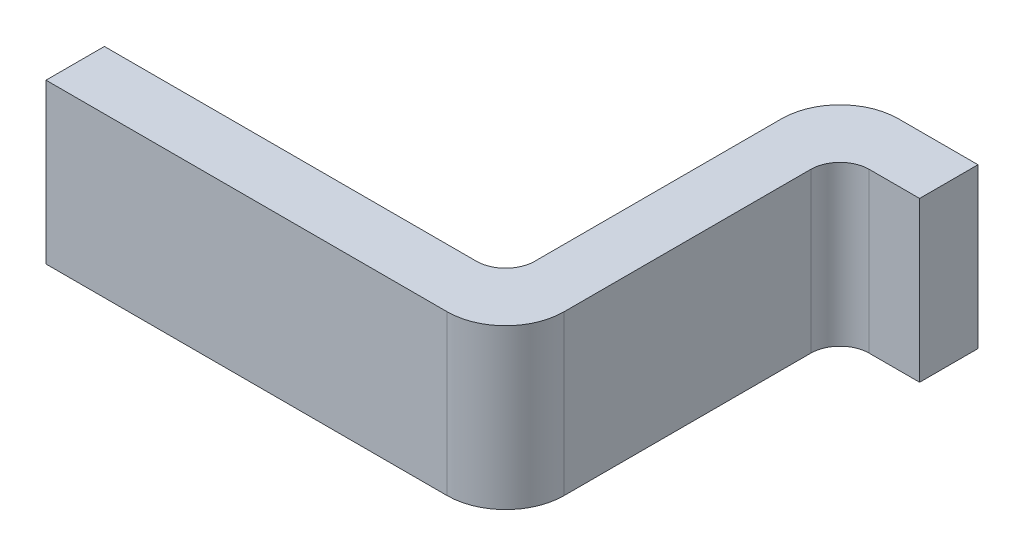
ISO-10303-21;
HEADER;
FILE_DESCRIPTION(('STEP AP214'),'2;1');
FILE_NAME('part.step','',(''),(''),'','','');
FILE_SCHEMA(('AUTOMOTIVE_DESIGN { 1 0 10303 214 1 1 1 1 }'));
ENDSEC;
DATA;
#1=APPLICATION_CONTEXT('core data for automotive mechanical design processes');
#2=APPLICATION_PROTOCOL_DEFINITION('international standard','automotive_design',2000,#1);
#3=PRODUCT_CONTEXT('',#1,'mechanical');
#4=PRODUCT('Part','Part','',(#3));
#5=PRODUCT_RELATED_PRODUCT_CATEGORY('part','',(#4));
#6=PRODUCT_DEFINITION_FORMATION('','',#4);
#7=PRODUCT_DEFINITION_CONTEXT('part definition',#1,'design');
#8=PRODUCT_DEFINITION('design','',#6,#7);
#9=PRODUCT_DEFINITION_SHAPE('','',#8);
#10=(LENGTH_UNIT() NAMED_UNIT(*) SI_UNIT(.MILLI.,.METRE.));
#11=(NAMED_UNIT(*) PLANE_ANGLE_UNIT() SI_UNIT($,.RADIAN.));
#12=(NAMED_UNIT(*) SI_UNIT($,.STERADIAN.) SOLID_ANGLE_UNIT());
#13=UNCERTAINTY_MEASURE_WITH_UNIT(LENGTH_MEASURE(1.E-05),#10,'distance_accuracy_value','');
#14=(GEOMETRIC_REPRESENTATION_CONTEXT(3) GLOBAL_UNCERTAINTY_ASSIGNED_CONTEXT((#13)) GLOBAL_UNIT_ASSIGNED_CONTEXT((#10,
#11,#12)) REPRESENTATION_CONTEXT('',''));
#15=CARTESIAN_POINT('',(0.,0.,0.));
#16=DIRECTION('',(0.,0.,1.));
#17=DIRECTION('',(1.,0.,0.));
#18=AXIS2_PLACEMENT_3D('',#15,#16,#17);
#19=CARTESIAN_POINT('',(1.155,0.,0.165));
#20=DIRECTION('',(0.,-1.,0.));
#21=DIRECTION('',(-0.707106781186548,0.,-0.707106781186547));
#22=AXIS2_PLACEMENT_3D('',#19,#20,#21);
#23=CYLINDRICAL_SURFACE('',#22,0.055);
#24=CARTESIAN_POINT('',(1.155,0.15,0.165));
#25=DIRECTION('',(0.,1.,0.));
#26=DIRECTION('',(0.,0.,-1.));
#27=AXIS2_PLACEMENT_3D('',#24,#25,#26);
#28=CIRCLE('',#27,0.055);
#29=CARTESIAN_POINT('',(1.155,0.15,0.11));
#30=VERTEX_POINT('',#29);
#31=CARTESIAN_POINT('',(1.1,0.15,0.165));
#32=VERTEX_POINT('',#31);
#33=EDGE_CURVE('E11',#30,#32,#28,.T.);
#34=ORIENTED_EDGE('',*,*,#33,.T.);
#35=DIRECTION('',(0.,-1.,0.));
#36=VECTOR('',#35,1.);
#37=CARTESIAN_POINT('',(1.1,0.15,0.165));
#38=LINE('',#37,#36);
#39=CARTESIAN_POINT('',(1.1,-0.15,0.165));
#40=VERTEX_POINT('',#39);
#41=EDGE_CURVE('E24',#32,#40,#38,.T.);
#42=ORIENTED_EDGE('',*,*,#41,.T.);
#43=CARTESIAN_POINT('',(1.155,-0.15,0.165));
#44=DIRECTION('',(0.,-1.,0.));
#45=DIRECTION('',(-1.,0.,0.));
#46=AXIS2_PLACEMENT_3D('',#43,#44,#45);
#47=CIRCLE('',#46,0.055);
#48=CARTESIAN_POINT('',(1.155,-0.15,0.11));
#49=VERTEX_POINT('',#48);
#50=EDGE_CURVE('E193',#40,#49,#47,.T.);
#51=ORIENTED_EDGE('',*,*,#50,.T.);
#52=DIRECTION('',(0.,1.,0.));
#53=VECTOR('',#52,1.);
#54=CARTESIAN_POINT('',(1.155,-0.15,0.11));
#55=LINE('',#54,#53);
#56=EDGE_CURVE('E186',#49,#30,#55,.T.);
#57=ORIENTED_EDGE('',*,*,#56,.T.);
#58=EDGE_LOOP('',(#34,#42,#51,#57));
#59=FACE_BOUND('',#58,.T.);
#60=ADVANCED_FACE('F17',(#59),#23,.F.);
#61=CARTESIAN_POINT('',(1.1,0.,0.739926666323614));
#62=DIRECTION('',(1.,0.,0.));
#63=DIRECTION('',(0.,0.,-1.));
#64=AXIS2_PLACEMENT_3D('',#61,#62,#63);
#65=PLANE('',#64);
#66=ORIENTED_EDGE('',*,*,#41,.F.);
#67=DIRECTION('',(0.,0.,-1.));
#68=VECTOR('',#67,1.);
#69=CARTESIAN_POINT('',(1.1,0.15,0.629926666323614));
#70=LINE('',#69,#68);
#71=CARTESIAN_POINT('',(1.1,0.15,0.629926666323614));
#72=VERTEX_POINT('',#71);
#73=EDGE_CURVE('E195',#72,#32,#70,.T.);
#74=ORIENTED_EDGE('',*,*,#73,.F.);
#75=DIRECTION('',(0.,1.,0.));
#76=VECTOR('',#75,1.);
#77=CARTESIAN_POINT('',(1.1,-0.15,0.629926666323614));
#78=LINE('',#77,#76);
#79=CARTESIAN_POINT('',(1.1,-0.15,0.629926666323614));
#80=VERTEX_POINT('',#79);
#81=EDGE_CURVE('E188',#80,#72,#78,.T.);
#82=ORIENTED_EDGE('',*,*,#81,.F.);
#83=DIRECTION('',(0.,0.,1.));
#84=VECTOR('',#83,1.);
#85=CARTESIAN_POINT('',(1.1,-0.15,0.165));
#86=LINE('',#85,#84);
#87=EDGE_CURVE('E176',#40,#80,#86,.T.);
#88=ORIENTED_EDGE('',*,*,#87,.F.);
#89=EDGE_LOOP('',(#66,#74,#82,#88));
#90=FACE_BOUND('',#89,.T.);
#91=ADVANCED_FACE('F228',(#90),#65,.T.);
#92=CARTESIAN_POINT('',(0.935,0.,0.574926666323615));
#93=DIRECTION('',(0.,1.,0.));
#94=DIRECTION('',(0.707106781186548,0.,0.707106781186547));
#95=AXIS2_PLACEMENT_3D('',#92,#93,#94);
#96=CYLINDRICAL_SURFACE('',#95,0.055);
#97=CARTESIAN_POINT('',(0.935,-0.15,0.574926666323615));
#98=DIRECTION('',(0.,-1.,0.));
#99=DIRECTION('',(1.,0.,0.));
#100=AXIS2_PLACEMENT_3D('',#97,#98,#99);
#101=CIRCLE('',#100,0.055);
#102=CARTESIAN_POINT('',(0.99,-0.15,0.574926666323615));
#103=VERTEX_POINT('',#102);
#104=CARTESIAN_POINT('',(0.935,-0.15,0.629926666323614));
#105=VERTEX_POINT('',#104);
#106=EDGE_CURVE('E197',#103,#105,#101,.T.);
#107=ORIENTED_EDGE('',*,*,#106,.T.);
#108=DIRECTION('',(0.,1.,0.));
#109=VECTOR('',#108,1.);
#110=CARTESIAN_POINT('',(0.935,-0.15,0.629926666323614));
#111=LINE('',#110,#109);
#112=CARTESIAN_POINT('',(0.935,0.15,0.629926666323614));
#113=VERTEX_POINT('',#112);
#114=EDGE_CURVE('E191',#105,#113,#111,.T.);
#115=ORIENTED_EDGE('',*,*,#114,.T.);
#116=CARTESIAN_POINT('',(0.935,0.15,0.574926666323615));
#117=DIRECTION('',(0.,1.,0.));
#118=DIRECTION('',(0.,0.,1.));
#119=AXIS2_PLACEMENT_3D('',#116,#117,#118);
#120=CIRCLE('',#119,0.055);
#121=CARTESIAN_POINT('',(0.99,0.15,0.574926666323615));
#122=VERTEX_POINT('',#121);
#123=EDGE_CURVE('E179',#113,#122,#120,.T.);
#124=ORIENTED_EDGE('',*,*,#123,.T.);
#125=DIRECTION('',(0.,-1.,0.));
#126=VECTOR('',#125,1.);
#127=CARTESIAN_POINT('',(0.99,0.15,0.574926666323615));
#128=LINE('',#127,#126);
#129=EDGE_CURVE('E174',#122,#103,#128,.T.);
#130=ORIENTED_EDGE('',*,*,#129,.T.);
#131=EDGE_LOOP('',(#107,#115,#124,#130));
#132=FACE_BOUND('',#131,.T.);
#133=ADVANCED_FACE('F201',(#132),#96,.F.);
#134=CARTESIAN_POINT('',(1.1,0.,0.629926666323614));
#135=DIRECTION('',(0.,0.,-1.));
#136=DIRECTION('',(-1.,0.,0.));
#137=AXIS2_PLACEMENT_3D('',#134,#135,#136);
#138=PLANE('',#137);
#139=ORIENTED_EDGE('',*,*,#114,.F.);
#140=DIRECTION('',(1.,0.,0.));
#141=VECTOR('',#140,1.);
#142=CARTESIAN_POINT('',(0.234180772746138,-0.15,0.629926666323614));
#143=LINE('',#142,#141);
#144=CARTESIAN_POINT('',(0.234180772746138,-0.15,0.629926666323615));
#145=VERTEX_POINT('',#144);
#146=EDGE_CURVE('E181',#145,#105,#143,.T.);
#147=ORIENTED_EDGE('',*,*,#146,.F.);
#148=DIRECTION('',(0.,1.,0.));
#149=VECTOR('',#148,1.);
#150=CARTESIAN_POINT('',(0.234180772746138,-0.15,0.629926666323615));
#151=LINE('',#150,#149);
#152=CARTESIAN_POINT('',(0.234180772746138,0.15,0.629926666323615));
#153=VERTEX_POINT('',#152);
#154=EDGE_CURVE('E170',#145,#153,#151,.T.);
#155=ORIENTED_EDGE('',*,*,#154,.T.);
#156=DIRECTION('',(-1.,0.,0.));
#157=VECTOR('',#156,1.);
#158=CARTESIAN_POINT('',(0.935,0.15,0.629926666323614));
#159=LINE('',#158,#157);
#160=EDGE_CURVE('E162',#113,#153,#159,.T.);
#161=ORIENTED_EDGE('',*,*,#160,.F.);
#162=EDGE_LOOP('',(#139,#147,#155,#161));
#163=FACE_BOUND('',#162,.T.);
#164=ADVANCED_FACE('F207',(#163),#138,.T.);
#165=CARTESIAN_POINT('',(1.1,0.,0.11));
#166=DIRECTION('',(0.,1.,0.));
#167=DIRECTION('',(-0.707106781186548,0.,-0.707106781186547));
#168=AXIS2_PLACEMENT_3D('',#165,#166,#167);
#169=CYLINDRICAL_SURFACE('',#168,0.11);
#170=CARTESIAN_POINT('',(1.1,0.15,0.11));
#171=DIRECTION('',(0.,-1.,0.));
#172=DIRECTION('',(-1.,0.,0.));
#173=AXIS2_PLACEMENT_3D('',#170,#171,#172);
#174=CIRCLE('',#173,0.11);
#175=CARTESIAN_POINT('',(0.99,0.15,0.11));
#176=VERTEX_POINT('',#175);
#177=CARTESIAN_POINT('',(1.1,0.15,0.));
#178=VERTEX_POINT('',#177);
#179=EDGE_CURVE('E184',#176,#178,#174,.T.);
#180=ORIENTED_EDGE('',*,*,#179,.T.);
#181=DIRECTION('',(0.,-1.,0.));
#182=VECTOR('',#181,1.);
#183=CARTESIAN_POINT('',(1.1,0.15,0.));
#184=LINE('',#183,#182);
#185=CARTESIAN_POINT('',(1.1,-0.15,0.));
#186=VERTEX_POINT('',#185);
#187=EDGE_CURVE('E172',#178,#186,#184,.T.);
#188=ORIENTED_EDGE('',*,*,#187,.T.);
#189=CARTESIAN_POINT('',(1.1,-0.15,0.11));
#190=DIRECTION('',(0.,1.,0.));
#191=DIRECTION('',(0.,0.,-1.));
#192=AXIS2_PLACEMENT_3D('',#189,#190,#191);
#193=CIRCLE('',#192,0.11);
#194=CARTESIAN_POINT('',(0.99,-0.15,0.11));
#195=VERTEX_POINT('',#194);
#196=EDGE_CURVE('E168',#186,#195,#193,.T.);
#197=ORIENTED_EDGE('',*,*,#196,.T.);
#198=DIRECTION('',(0.,1.,0.));
#199=VECTOR('',#198,1.);
#200=CARTESIAN_POINT('',(0.99,-0.15,0.11));
#201=LINE('',#200,#199);
#202=EDGE_CURVE('E155',#195,#176,#201,.T.);
#203=ORIENTED_EDGE('',*,*,#202,.T.);
#204=EDGE_LOOP('',(#180,#188,#197,#203));
#205=FACE_BOUND('',#204,.T.);
#206=ADVANCED_FACE('F244',(#205),#169,.T.);
#207=CARTESIAN_POINT('',(0.99,0.,0.));
#208=DIRECTION('',(-1.,0.,0.));
#209=DIRECTION('',(0.,0.,1.));
#210=AXIS2_PLACEMENT_3D('',#207,#208,#209);
#211=PLANE('',#210);
#212=ORIENTED_EDGE('',*,*,#129,.F.);
#213=DIRECTION('',(0.,0.,1.));
#214=VECTOR('',#213,1.);
#215=CARTESIAN_POINT('',(0.99,0.15,0.11));
#216=LINE('',#215,#214);
#217=EDGE_CURVE('E165',#176,#122,#216,.T.);
#218=ORIENTED_EDGE('',*,*,#217,.F.);
#219=ORIENTED_EDGE('',*,*,#202,.F.);
#220=DIRECTION('',(0.,0.,-1.));
#221=VECTOR('',#220,1.);
#222=CARTESIAN_POINT('',(0.99,-0.15,0.574926666323615));
#223=LINE('',#222,#221);
#224=EDGE_CURVE('E148',#103,#195,#223,.T.);
#225=ORIENTED_EDGE('',*,*,#224,.F.);
#226=EDGE_LOOP('',(#212,#218,#219,#225));
#227=FACE_BOUND('',#226,.T.);
#228=ADVANCED_FACE('F219',(#227),#211,.T.);
#229=CARTESIAN_POINT('',(0.667090386373069,-0.15,0.684926666323614));
#230=DIRECTION('',(0.,-1.,0.));
#231=DIRECTION('',(0.,0.,-1.));
#232=AXIS2_PLACEMENT_3D('',#229,#230,#231);
#233=PLANE('',#232);
#234=ORIENTED_EDGE('',*,*,#196,.F.);
#235=DIRECTION('',(1.,0.,0.));
#236=VECTOR('',#235,1.);
#237=CARTESIAN_POINT('',(1.1,-0.15,0.));
#238=LINE('',#237,#236);
#239=CARTESIAN_POINT('',(1.25,-0.15,0.));
#240=VERTEX_POINT('',#239);
#241=EDGE_CURVE('E158',#186,#240,#238,.T.);
#242=ORIENTED_EDGE('',*,*,#241,.T.);
#243=DIRECTION('',(0.,0.,1.));
#244=VECTOR('',#243,1.);
#245=CARTESIAN_POINT('',(1.25,-0.15,0.));
#246=LINE('',#245,#244);
#247=CARTESIAN_POINT('',(1.25,-0.15,0.11));
#248=VERTEX_POINT('',#247);
#249=EDGE_CURVE('E151',#240,#248,#246,.T.);
#250=ORIENTED_EDGE('',*,*,#249,.T.);
#251=DIRECTION('',(-1.,0.,0.));
#252=VECTOR('',#251,1.);
#253=CARTESIAN_POINT('',(1.25,-0.15,0.11));
#254=LINE('',#253,#252);
#255=EDGE_CURVE('E120',#248,#49,#254,.T.);
#256=ORIENTED_EDGE('',*,*,#255,.T.);
#257=ORIENTED_EDGE('',*,*,#50,.F.);
#258=ORIENTED_EDGE('',*,*,#87,.T.);
#259=CARTESIAN_POINT('',(0.99,-0.15,0.629926666323614));
#260=DIRECTION('',(0.,1.,0.));
#261=DIRECTION('',(0.,0.,1.));
#262=AXIS2_PLACEMENT_3D('',#259,#260,#261);
#263=CIRCLE('',#262,0.11);
#264=CARTESIAN_POINT('',(0.99,-0.15,0.739926666323614));
#265=VERTEX_POINT('',#264);
#266=EDGE_CURVE('E142',#265,#80,#263,.T.);
#267=ORIENTED_EDGE('',*,*,#266,.F.);
#268=DIRECTION('',(-1.,0.,0.));
#269=VECTOR('',#268,1.);
#270=CARTESIAN_POINT('',(0.99,-0.15,0.739926666323614));
#271=LINE('',#270,#269);
#272=CARTESIAN_POINT('',(0.234180772746138,-0.15,0.739926666323615));
#273=VERTEX_POINT('',#272);
#274=EDGE_CURVE('E132',#265,#273,#271,.T.);
#275=ORIENTED_EDGE('',*,*,#274,.T.);
#276=DIRECTION('',(0.,0.,-1.));
#277=VECTOR('',#276,1.);
#278=CARTESIAN_POINT('',(0.234180772746138,-0.15,0.739926666323615));
#279=LINE('',#278,#277);
#280=EDGE_CURVE('E111',#273,#145,#279,.T.);
#281=ORIENTED_EDGE('',*,*,#280,.T.);
#282=ORIENTED_EDGE('',*,*,#146,.T.);
#283=ORIENTED_EDGE('',*,*,#106,.F.);
#284=ORIENTED_EDGE('',*,*,#224,.T.);
#285=EDGE_LOOP('',(#234,#242,#250,#256,#257,#258,#267,#275,#281,#282,#283,#284));
#286=FACE_BOUND('',#285,.T.);
#287=ADVANCED_FACE('F211',(#286),#233,.T.);
#288=CARTESIAN_POINT('',(0.99,0.,0.629926666323614));
#289=DIRECTION('',(0.,1.,0.));
#290=DIRECTION('',(0.707106781186548,0.,0.707106781186548));
#291=AXIS2_PLACEMENT_3D('',#288,#289,#290);
#292=CYLINDRICAL_SURFACE('',#291,0.11);
#293=CARTESIAN_POINT('',(0.99,0.15,0.629926666323614));
#294=DIRECTION('',(0.,-1.,0.));
#295=DIRECTION('',(1.,0.,0.));
#296=AXIS2_PLACEMENT_3D('',#293,#294,#295);
#297=CIRCLE('',#296,0.11);
#298=CARTESIAN_POINT('',(0.99,0.15,0.739926666323614));
#299=VERTEX_POINT('',#298);
#300=EDGE_CURVE('E160',#72,#299,#297,.T.);
#301=ORIENTED_EDGE('',*,*,#300,.T.);
#302=DIRECTION('',(0.,-1.,0.));
#303=VECTOR('',#302,1.);
#304=CARTESIAN_POINT('',(0.99,0.15,0.739926666323614));
#305=LINE('',#304,#303);
#306=EDGE_CURVE('E153',#299,#265,#305,.T.);
#307=ORIENTED_EDGE('',*,*,#306,.T.);
#308=ORIENTED_EDGE('',*,*,#266,.T.);
#309=ORIENTED_EDGE('',*,*,#81,.T.);
#310=EDGE_LOOP('',(#301,#307,#308,#309));
#311=FACE_BOUND('',#310,.T.);
#312=ADVANCED_FACE('F247',(#311),#292,.T.);
#313=CARTESIAN_POINT('',(0.99,0.,0.739926666323614));
#314=DIRECTION('',(0.,0.,1.));
#315=DIRECTION('',(1.,0.,0.));
#316=AXIS2_PLACEMENT_3D('',#313,#314,#315);
#317=PLANE('',#316);
#318=ORIENTED_EDGE('',*,*,#306,.F.);
#319=DIRECTION('',(1.,0.,0.));
#320=VECTOR('',#319,1.);
#321=CARTESIAN_POINT('',(0.234180772746138,0.15,0.739926666323615));
#322=LINE('',#321,#320);
#323=CARTESIAN_POINT('',(0.234180772746138,0.15,0.739926666323615));
#324=VERTEX_POINT('',#323);
#325=EDGE_CURVE('E145',#324,#299,#322,.T.);
#326=ORIENTED_EDGE('',*,*,#325,.F.);
#327=DIRECTION('',(0.,1.,0.));
#328=VECTOR('',#327,1.);
#329=CARTESIAN_POINT('',(0.234180772746138,-0.15,0.739926666323615));
#330=LINE('',#329,#328);
#331=EDGE_CURVE('E138',#273,#324,#330,.T.);
#332=ORIENTED_EDGE('',*,*,#331,.F.);
#333=ORIENTED_EDGE('',*,*,#274,.F.);
#334=EDGE_LOOP('',(#318,#326,#332,#333));
#335=FACE_BOUND('',#334,.T.);
#336=ADVANCED_FACE('F240',(#335),#317,.T.);
#337=CARTESIAN_POINT('',(0.667090386373069,0.15,0.684926666323614));
#338=DIRECTION('',(0.,1.,0.));
#339=DIRECTION('',(0.,0.,1.));
#340=AXIS2_PLACEMENT_3D('',#337,#338,#339);
#341=PLANE('',#340);
#342=ORIENTED_EDGE('',*,*,#179,.F.);
#343=ORIENTED_EDGE('',*,*,#217,.T.);
#344=ORIENTED_EDGE('',*,*,#123,.F.);
#345=ORIENTED_EDGE('',*,*,#160,.T.);
#346=DIRECTION('',(0.,0.,1.));
#347=VECTOR('',#346,1.);
#348=CARTESIAN_POINT('',(0.234180772746138,0.15,0.629926666323615));
#349=LINE('',#348,#347);
#350=EDGE_CURVE('E135',#153,#324,#349,.T.);
#351=ORIENTED_EDGE('',*,*,#350,.T.);
#352=ORIENTED_EDGE('',*,*,#325,.T.);
#353=ORIENTED_EDGE('',*,*,#300,.F.);
#354=ORIENTED_EDGE('',*,*,#73,.T.);
#355=ORIENTED_EDGE('',*,*,#33,.F.);
#356=DIRECTION('',(1.,0.,0.));
#357=VECTOR('',#356,1.);
#358=CARTESIAN_POINT('',(1.155,0.15,0.11));
#359=LINE('',#358,#357);
#360=CARTESIAN_POINT('',(1.25,0.15,0.11));
#361=VERTEX_POINT('',#360);
#362=EDGE_CURVE('E118',#30,#361,#359,.T.);
#363=ORIENTED_EDGE('',*,*,#362,.T.);
#364=DIRECTION('',(0.,0.,-1.));
#365=VECTOR('',#364,1.);
#366=CARTESIAN_POINT('',(1.25,0.15,0.11));
#367=LINE('',#366,#365);
#368=CARTESIAN_POINT('',(1.25,0.15,0.));
#369=VERTEX_POINT('',#368);
#370=EDGE_CURVE('E101',#361,#369,#367,.T.);
#371=ORIENTED_EDGE('',*,*,#370,.T.);
#372=DIRECTION('',(-1.,0.,0.));
#373=VECTOR('',#372,1.);
#374=CARTESIAN_POINT('',(1.25,0.15,0.));
#375=LINE('',#374,#373);
#376=EDGE_CURVE('E130',#369,#178,#375,.T.);
#377=ORIENTED_EDGE('',*,*,#376,.T.);
#378=EDGE_LOOP('',(#342,#343,#344,#345,#351,#352,#353,#354,#355,#363,#371,#377));
#379=FACE_BOUND('',#378,.T.);
#380=ADVANCED_FACE('F123',(#379),#341,.T.);
#381=CARTESIAN_POINT('',(0.234180772746138,0.,0.629926666323615));
#382=DIRECTION('',(-1.,0.,0.));
#383=DIRECTION('',(0.,0.,1.));
#384=AXIS2_PLACEMENT_3D('',#381,#382,#383);
#385=PLANE('',#384);
#386=ORIENTED_EDGE('',*,*,#331,.T.);
#387=ORIENTED_EDGE('',*,*,#350,.F.);
#388=ORIENTED_EDGE('',*,*,#154,.F.);
#389=ORIENTED_EDGE('',*,*,#280,.F.);
#390=EDGE_LOOP('',(#386,#387,#388,#389));
#391=FACE_BOUND('',#390,.T.);
#392=ADVANCED_FACE('F216',(#391),#385,.T.);
#393=CARTESIAN_POINT('',(1.25,0.,0.));
#394=DIRECTION('',(0.,0.,-1.));
#395=DIRECTION('',(-1.,0.,0.));
#396=AXIS2_PLACEMENT_3D('',#393,#394,#395);
#397=PLANE('',#396);
#398=ORIENTED_EDGE('',*,*,#187,.F.);
#399=ORIENTED_EDGE('',*,*,#376,.F.);
#400=DIRECTION('',(0.,-1.,0.));
#401=VECTOR('',#400,1.);
#402=CARTESIAN_POINT('',(1.25,0.15,0.));
#403=LINE('',#402,#401);
#404=EDGE_CURVE('E107',#369,#240,#403,.T.);
#405=ORIENTED_EDGE('',*,*,#404,.T.);
#406=ORIENTED_EDGE('',*,*,#241,.F.);
#407=EDGE_LOOP('',(#398,#399,#405,#406));
#408=FACE_BOUND('',#407,.T.);
#409=ADVANCED_FACE('F225',(#408),#397,.T.);
#410=CARTESIAN_POINT('',(0.99,0.,0.11));
#411=DIRECTION('',(0.,0.,1.));
#412=DIRECTION('',(1.,0.,0.));
#413=AXIS2_PLACEMENT_3D('',#410,#411,#412);
#414=PLANE('',#413);
#415=ORIENTED_EDGE('',*,*,#56,.F.);
#416=ORIENTED_EDGE('',*,*,#255,.F.);
#417=DIRECTION('',(0.,1.,0.));
#418=VECTOR('',#417,1.);
#419=CARTESIAN_POINT('',(1.25,-0.15,0.11));
#420=LINE('',#419,#418);
#421=EDGE_CURVE('E105',#248,#361,#420,.T.);
#422=ORIENTED_EDGE('',*,*,#421,.T.);
#423=ORIENTED_EDGE('',*,*,#362,.F.);
#424=EDGE_LOOP('',(#415,#416,#422,#423));
#425=FACE_BOUND('',#424,.T.);
#426=ADVANCED_FACE('F117',(#425),#414,.T.);
#427=CARTESIAN_POINT('',(1.25,0.,0.11));
#428=DIRECTION('',(1.,0.,0.));
#429=DIRECTION('',(0.,0.,-1.));
#430=AXIS2_PLACEMENT_3D('',#427,#428,#429);
#431=PLANE('',#430);
#432=ORIENTED_EDGE('',*,*,#404,.F.);
#433=ORIENTED_EDGE('',*,*,#370,.F.);
#434=ORIENTED_EDGE('',*,*,#421,.F.);
#435=ORIENTED_EDGE('',*,*,#249,.F.);
#436=EDGE_LOOP('',(#432,#433,#434,#435));
#437=FACE_BOUND('',#436,.T.);
#438=ADVANCED_FACE('F103',(#437),#431,.T.);
#439=CLOSED_SHELL('',(#60,#91,#133,#164,#206,#228,#287,#312,#336,#380,#392,#409,#426,#438));
#440=MANIFOLD_SOLID_BREP('B1',#439);
#441=ADVANCED_BREP_SHAPE_REPRESENTATION('',(#18,#440),#14);
#442=SHAPE_DEFINITION_REPRESENTATION(#9,#441);
ENDSEC;
END-ISO-10303-21;
